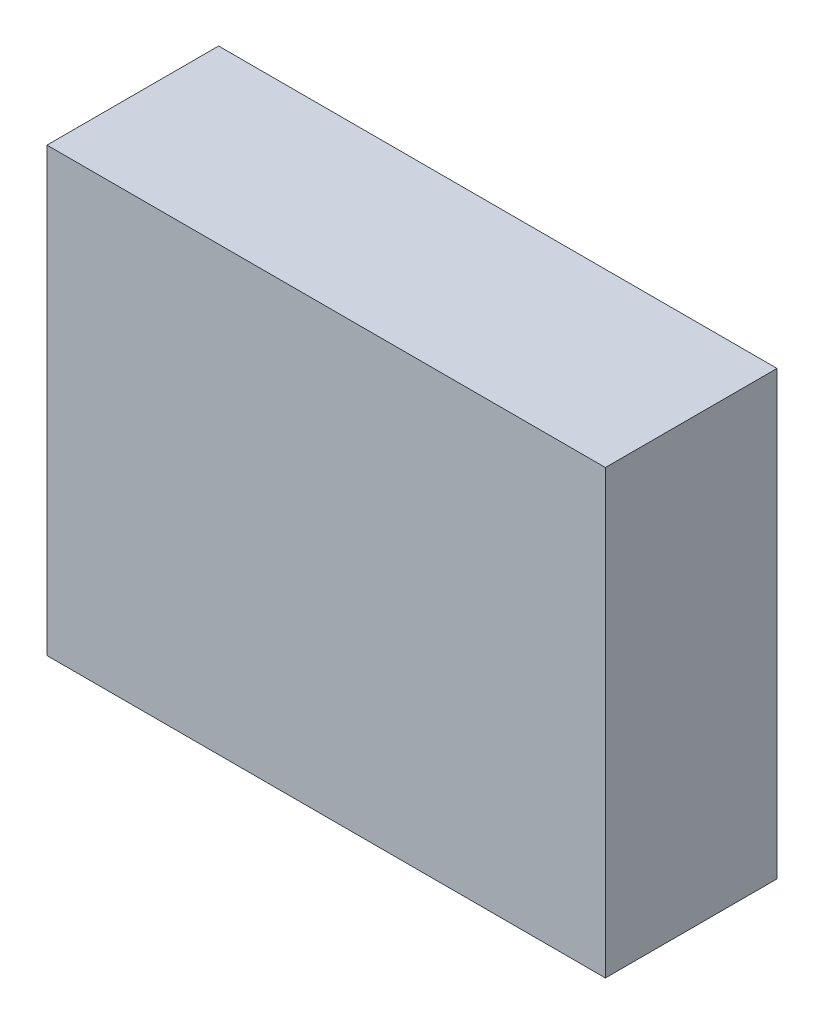
ISO-10303-21;
HEADER;
FILE_DESCRIPTION(('STEP AP214'),'2;1');
FILE_NAME('part.step','',(''),(''),'','','');
FILE_SCHEMA(('AUTOMOTIVE_DESIGN { 1 0 10303 214 1 1 1 1 }'));
ENDSEC;
DATA;
#1=APPLICATION_CONTEXT('core data for automotive mechanical design processes');
#2=APPLICATION_PROTOCOL_DEFINITION('international standard','automotive_design',2000,#1);
#3=PRODUCT_CONTEXT('',#1,'mechanical');
#4=PRODUCT('Part','Part','',(#3));
#5=PRODUCT_RELATED_PRODUCT_CATEGORY('part','',(#4));
#6=PRODUCT_DEFINITION_FORMATION('','',#4);
#7=PRODUCT_DEFINITION_CONTEXT('part definition',#1,'design');
#8=PRODUCT_DEFINITION('design','',#6,#7);
#9=PRODUCT_DEFINITION_SHAPE('','',#8);
#10=(LENGTH_UNIT() NAMED_UNIT(*) SI_UNIT(.MILLI.,.METRE.));
#11=(NAMED_UNIT(*) PLANE_ANGLE_UNIT() SI_UNIT($,.RADIAN.));
#12=(NAMED_UNIT(*) SI_UNIT($,.STERADIAN.) SOLID_ANGLE_UNIT());
#13=UNCERTAINTY_MEASURE_WITH_UNIT(LENGTH_MEASURE(1.E-05),#10,'distance_accuracy_value','');
#14=(GEOMETRIC_REPRESENTATION_CONTEXT(3) GLOBAL_UNCERTAINTY_ASSIGNED_CONTEXT((#13)) GLOBAL_UNIT_ASSIGNED_CONTEXT((#10,
#11,#12)) REPRESENTATION_CONTEXT('',''));
#15=CARTESIAN_POINT('',(0.,0.,0.));
#16=DIRECTION('',(0.,0.,1.));
#17=DIRECTION('',(1.,0.,0.));
#18=AXIS2_PLACEMENT_3D('',#15,#16,#17);
#19=CARTESIAN_POINT('',(-2.52000004,1.99499982,1.549));
#20=DIRECTION('',(0.,0.,1.));
#21=DIRECTION('',(1.,0.,0.));
#22=AXIS2_PLACEMENT_3D('',#19,#20,#21);
#23=PLANE('',#22);
#24=DIRECTION('',(0.,1.,0.));
#25=VECTOR('',#24,1.);
#26=CARTESIAN_POINT('',(2.52000004,1.99499982,1.549));
#27=LINE('',#26,#25);
#28=CARTESIAN_POINT('',(2.52000004,1.99499982,1.549));
#29=VERTEX_POINT('',#28);
#30=CARTESIAN_POINT('',(2.52000004,-1.99499982,1.549));
#31=VERTEX_POINT('',#30);
#32=EDGE_CURVE('E52',#29,#31,#27,.F.);
#33=ORIENTED_EDGE('',*,*,#32,.F.);
#34=DIRECTION('',(1.,0.,0.));
#35=VECTOR('',#34,1.);
#36=CARTESIAN_POINT('',(-2.52000004,1.99499982,1.549));
#37=LINE('',#36,#35);
#38=CARTESIAN_POINT('',(-2.52000004,1.99499982,1.549));
#39=VERTEX_POINT('',#38);
#40=EDGE_CURVE('E67',#39,#29,#37,.T.);
#41=ORIENTED_EDGE('',*,*,#40,.F.);
#42=DIRECTION('',(0.,1.,0.));
#43=VECTOR('',#42,1.);
#44=CARTESIAN_POINT('',(-2.52000004,-1.99499982,1.549));
#45=LINE('',#44,#43);
#46=CARTESIAN_POINT('',(-2.52000004,-1.99499982,1.549));
#47=VERTEX_POINT('',#46);
#48=EDGE_CURVE('E19',#47,#39,#45,.T.);
#49=ORIENTED_EDGE('',*,*,#48,.F.);
#50=DIRECTION('',(1.,0.,0.));
#51=VECTOR('',#50,1.);
#52=CARTESIAN_POINT('',(2.52000004,-1.99499982,1.549));
#53=LINE('',#52,#51);
#54=EDGE_CURVE('E57',#31,#47,#53,.F.);
#55=ORIENTED_EDGE('',*,*,#54,.F.);
#56=EDGE_LOOP('',(#33,#41,#49,#55));
#57=FACE_BOUND('',#56,.T.);
#58=ADVANCED_FACE('F16',(#57),#23,.T.);
#59=CARTESIAN_POINT('',(-2.52000004,-1.99499982,0.));
#60=DIRECTION('',(-1.,0.,0.));
#61=DIRECTION('',(0.,0.,1.));
#62=AXIS2_PLACEMENT_3D('',#59,#60,#61);
#63=PLANE('',#62);
#64=DIRECTION('',(0.,0.,1.));
#65=VECTOR('',#64,1.);
#66=CARTESIAN_POINT('',(-2.52000004,1.99499982,0.));
#67=LINE('',#66,#65);
#68=CARTESIAN_POINT('',(-2.52000004,1.99499982,0.));
#69=VERTEX_POINT('',#68);
#70=EDGE_CURVE('E78',#69,#39,#67,.T.);
#71=ORIENTED_EDGE('',*,*,#70,.F.);
#72=DIRECTION('',(0.,1.,0.));
#73=VECTOR('',#72,1.);
#74=CARTESIAN_POINT('',(-2.52000004,1.99499982,0.));
#75=LINE('',#74,#73);
#76=CARTESIAN_POINT('',(-2.52000004,-1.99499982,0.));
#77=VERTEX_POINT('',#76);
#78=EDGE_CURVE('E73',#69,#77,#75,.F.);
#79=ORIENTED_EDGE('',*,*,#78,.T.);
#80=DIRECTION('',(0.,0.,-1.));
#81=VECTOR('',#80,1.);
#82=CARTESIAN_POINT('',(-2.52000004,-1.99499982,0.));
#83=LINE('',#82,#81);
#84=EDGE_CURVE('E62',#47,#77,#83,.T.);
#85=ORIENTED_EDGE('',*,*,#84,.F.);
#86=ORIENTED_EDGE('',*,*,#48,.T.);
#87=EDGE_LOOP('',(#71,#79,#85,#86));
#88=FACE_BOUND('',#87,.T.);
#89=ADVANCED_FACE('F72',(#88),#63,.T.);
#90=CARTESIAN_POINT('',(2.52000004,-1.99499982,0.));
#91=DIRECTION('',(0.,-1.,0.));
#92=DIRECTION('',(0.,0.,-1.));
#93=AXIS2_PLACEMENT_3D('',#90,#91,#92);
#94=PLANE('',#93);
#95=ORIENTED_EDGE('',*,*,#84,.T.);
#96=DIRECTION('',(1.,0.,0.));
#97=VECTOR('',#96,1.);
#98=CARTESIAN_POINT('',(-2.52000004,-1.99499982,0.));
#99=LINE('',#98,#97);
#100=CARTESIAN_POINT('',(2.52000004,-1.99499982,0.));
#101=VERTEX_POINT('',#100);
#102=EDGE_CURVE('E83',#77,#101,#99,.T.);
#103=ORIENTED_EDGE('',*,*,#102,.T.);
#104=DIRECTION('',(0.,0.,-1.));
#105=VECTOR('',#104,1.);
#106=CARTESIAN_POINT('',(2.52000004,-1.99499982,0.));
#107=LINE('',#106,#105);
#108=EDGE_CURVE('E64',#31,#101,#107,.T.);
#109=ORIENTED_EDGE('',*,*,#108,.F.);
#110=ORIENTED_EDGE('',*,*,#54,.T.);
#111=EDGE_LOOP('',(#95,#103,#109,#110));
#112=FACE_BOUND('',#111,.T.);
#113=ADVANCED_FACE('F59',(#112),#94,.T.);
#114=CARTESIAN_POINT('',(2.52000004,1.99499982,0.));
#115=DIRECTION('',(1.,0.,0.));
#116=DIRECTION('',(0.,0.,-1.));
#117=AXIS2_PLACEMENT_3D('',#114,#115,#116);
#118=PLANE('',#117);
#119=ORIENTED_EDGE('',*,*,#108,.T.);
#120=DIRECTION('',(0.,1.,0.));
#121=VECTOR('',#120,1.);
#122=CARTESIAN_POINT('',(2.52000004,1.99499982,0.));
#123=LINE('',#122,#121);
#124=CARTESIAN_POINT('',(2.52000004,1.99499982,0.));
#125=VERTEX_POINT('',#124);
#126=EDGE_CURVE('E25',#101,#125,#123,.T.);
#127=ORIENTED_EDGE('',*,*,#126,.T.);
#128=DIRECTION('',(0.,0.,1.));
#129=VECTOR('',#128,1.);
#130=CARTESIAN_POINT('',(2.52000004,1.99499982,0.));
#131=LINE('',#130,#129);
#132=EDGE_CURVE('E33',#29,#125,#131,.F.);
#133=ORIENTED_EDGE('',*,*,#132,.F.);
#134=ORIENTED_EDGE('',*,*,#32,.T.);
#135=EDGE_LOOP('',(#119,#127,#133,#134));
#136=FACE_BOUND('',#135,.T.);
#137=ADVANCED_FACE('F87',(#136),#118,.T.);
#138=CARTESIAN_POINT('',(-2.52000004,1.99499982,0.));
#139=DIRECTION('',(0.,1.,0.));
#140=DIRECTION('',(0.,0.,1.));
#141=AXIS2_PLACEMENT_3D('',#138,#139,#140);
#142=PLANE('',#141);
#143=ORIENTED_EDGE('',*,*,#132,.T.);
#144=DIRECTION('',(1.,0.,0.));
#145=VECTOR('',#144,1.);
#146=CARTESIAN_POINT('',(-2.52000004,1.99499982,0.));
#147=LINE('',#146,#145);
#148=EDGE_CURVE('E10',#125,#69,#147,.F.);
#149=ORIENTED_EDGE('',*,*,#148,.T.);
#150=ORIENTED_EDGE('',*,*,#70,.T.);
#151=ORIENTED_EDGE('',*,*,#40,.T.);
#152=EDGE_LOOP('',(#143,#149,#150,#151));
#153=FACE_BOUND('',#152,.T.);
#154=ADVANCED_FACE('F90',(#153),#142,.T.);
#155=CARTESIAN_POINT('',(-2.52000004,1.99499982,0.));
#156=DIRECTION('',(0.,0.,1.));
#157=DIRECTION('',(1.,0.,0.));
#158=AXIS2_PLACEMENT_3D('',#155,#156,#157);
#159=PLANE('',#158);
#160=ORIENTED_EDGE('',*,*,#126,.F.);
#161=ORIENTED_EDGE('',*,*,#102,.F.);
#162=ORIENTED_EDGE('',*,*,#78,.F.);
#163=ORIENTED_EDGE('',*,*,#148,.F.);
#164=EDGE_LOOP('',(#160,#161,#162,#163));
#165=FACE_BOUND('',#164,.T.);
#166=ADVANCED_FACE('F89',(#165),#159,.F.);
#167=CLOSED_SHELL('',(#58,#89,#113,#137,#154,#166));
#168=MANIFOLD_SOLID_BREP('B1',#167);
#169=ADVANCED_BREP_SHAPE_REPRESENTATION('',(#18,#168),#14);
#170=SHAPE_DEFINITION_REPRESENTATION(#9,#169);
ENDSEC;
END-ISO-10303-21;
